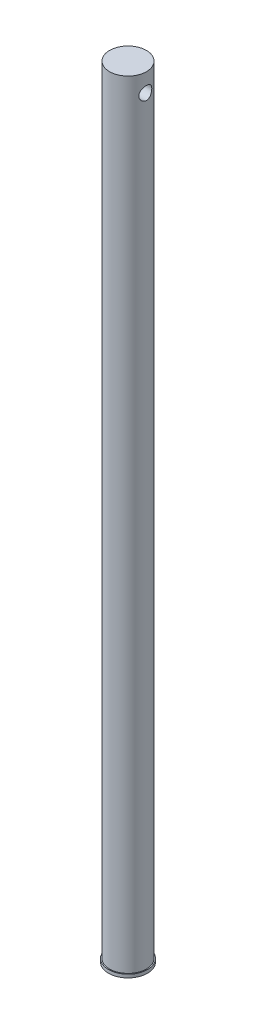
ISO-10303-21;
HEADER;
FILE_DESCRIPTION(('STEP AP214'),'2;1');
FILE_NAME('part.step','',(''),(''),'','','');
FILE_SCHEMA(('AUTOMOTIVE_DESIGN { 1 0 10303 214 1 1 1 1 }'));
ENDSEC;
DATA;
#1=APPLICATION_CONTEXT('core data for automotive mechanical design processes');
#2=APPLICATION_PROTOCOL_DEFINITION('international standard','automotive_design',2000,#1);
#3=PRODUCT_CONTEXT('',#1,'mechanical');
#4=PRODUCT('Part','Part','',(#3));
#5=PRODUCT_RELATED_PRODUCT_CATEGORY('part','',(#4));
#6=PRODUCT_DEFINITION_FORMATION('','',#4);
#7=PRODUCT_DEFINITION_CONTEXT('part definition',#1,'design');
#8=PRODUCT_DEFINITION('design','',#6,#7);
#9=PRODUCT_DEFINITION_SHAPE('','',#8);
#10=(LENGTH_UNIT() NAMED_UNIT(*) SI_UNIT(.MILLI.,.METRE.));
#11=(NAMED_UNIT(*) PLANE_ANGLE_UNIT() SI_UNIT($,.RADIAN.));
#12=(NAMED_UNIT(*) SI_UNIT($,.STERADIAN.) SOLID_ANGLE_UNIT());
#13=UNCERTAINTY_MEASURE_WITH_UNIT(LENGTH_MEASURE(1.E-05),#10,'distance_accuracy_value','');
#14=(GEOMETRIC_REPRESENTATION_CONTEXT(3) GLOBAL_UNCERTAINTY_ASSIGNED_CONTEXT((#13)) GLOBAL_UNIT_ASSIGNED_CONTEXT((#10,
#11,#12)) REPRESENTATION_CONTEXT('',''));
#15=CARTESIAN_POINT('',(0.,0.,0.));
#16=DIRECTION('',(0.,0.,1.));
#17=DIRECTION('',(1.,0.,0.));
#18=AXIS2_PLACEMENT_3D('',#15,#16,#17);
#19=CARTESIAN_POINT('',(0.,381.,0.));
#20=DIRECTION('',(0.,-1.,0.));
#21=DIRECTION('',(0.,0.,-1.));
#22=AXIS2_PLACEMENT_3D('',#19,#20,#21);
#23=CYLINDRICAL_SURFACE('',#22,9.);
#24=CARTESIAN_POINT('',(-8.42136420065063,372.,-3.175));
#25=CARTESIAN_POINT('',(-8.42136150974084,372.172273779632,-3.17500313367558));
#26=CARTESIAN_POINT('',(-8.42670808089815,372.344525767534,-3.16093167724255));
#27=CARTESIAN_POINT('',(-8.44738831325761,372.683885201858,-3.10523707874647));
#28=CARTESIAN_POINT('',(-8.4627226722881,372.850992287961,-3.06361201156008));
#29=CARTESIAN_POINT('',(-8.50142999230871,373.175081631049,-2.95448773313072));
#30=CARTESIAN_POINT('',(-8.5247856310422,373.332084847263,-2.88704424206036));
#31=CARTESIAN_POINT('',(-8.57687751912031,373.632604430906,-2.72839140382439));
#32=CARTESIAN_POINT('',(-8.60561516505424,373.776117283138,-2.63717588559013));
#33=CARTESIAN_POINT('',(-8.66664704765721,374.051881093915,-2.42927986210608));
#34=CARTESIAN_POINT('',(-8.699037413213,374.183454740443,-2.3117289294745));
#35=CARTESIAN_POINT('',(-8.76291757980477,374.425490061538,-2.05635163465563));
#36=CARTESIAN_POINT('',(-8.79440721491501,374.535947867335,-1.91852156516495));
#37=CARTESIAN_POINT('',(-8.85406424843501,374.735774241258,-1.62146040606909));
#38=CARTESIAN_POINT('',(-8.88210559213286,374.824421115152,-1.46171628450465));
#39=CARTESIAN_POINT('',(-8.93056365003233,374.973309950242,-1.1284216480992));
#40=CARTESIAN_POINT('',(-8.9509826830258,375.033560551368,-0.954875351553854));
#41=CARTESIAN_POINT('',(-8.98121392113146,375.121614293695,-0.606013116693167));
#42=CARTESIAN_POINT('',(-8.99140518987648,375.150580331684,-0.431024170453733));
#43=CARTESIAN_POINT('',(-9.00138488825874,375.178953204662,-0.0783923821029128));
#44=CARTESIAN_POINT('',(-9.00117631468531,375.178368554894,0.0992496807437582));
#45=CARTESIAN_POINT('',(-8.99062960898661,375.148366984619,0.443867105376793));
#46=CARTESIAN_POINT('',(-8.98073619267481,375.120215863683,0.610968563133427));
#47=CARTESIAN_POINT('',(-8.95250107946052,375.037989967142,0.93790229861018));
#48=CARTESIAN_POINT('',(-8.93415879527837,374.983913389449,1.09773407016671));
#49=CARTESIAN_POINT('',(-8.89055004160788,374.850702748335,1.40821090083163));
#50=CARTESIAN_POINT('',(-8.8651910247344,374.771231402723,1.55869771253312));
#51=CARTESIAN_POINT('',(-8.81015552569046,374.58977369596,1.84455431214103));
#52=CARTESIAN_POINT('',(-8.78047774895497,374.48778057906,1.97991954571352));
#53=CARTESIAN_POINT('',(-8.71806923990129,374.257920276167,2.23919184160651));
#54=CARTESIAN_POINT('',(-8.68526001664206,374.128978474742,2.36212873401556));
#55=CARTESIAN_POINT('',(-8.62156508884072,373.852063501979,2.58497190998503));
#56=CARTESIAN_POINT('',(-8.59067976039008,373.704086626801,2.68487370078944));
#57=CARTESIAN_POINT('',(-8.53386949631555,373.389890227687,2.86037801067268));
#58=CARTESIAN_POINT('',(-8.50804171526517,373.223394857504,2.93552060796845));
#59=CARTESIAN_POINT('',(-8.46539125944423,372.878967392437,3.05635497519198));
#60=CARTESIAN_POINT('',(-8.44856426022347,372.701040835807,3.10206089021179));
#61=CARTESIAN_POINT('',(-8.42681771259573,372.348291238941,3.16064500486847));
#62=CARTESIAN_POINT('',(-8.42134684933665,372.173754987769,3.17504482542608));
#63=CARTESIAN_POINT('',(-8.42138162146706,371.824711871225,3.17495498997333));
#64=CARTESIAN_POINT('',(-8.42688494288389,371.650205007416,3.16047142419816));
#65=CARTESIAN_POINT('',(-8.44769353226338,371.313483758113,3.10439935241744));
#66=CARTESIAN_POINT('',(-8.46259711219546,371.151057016621,3.06392043873685));
#67=CARTESIAN_POINT('',(-8.50006929550216,370.835351257663,2.95836719697569));
#68=CARTESIAN_POINT('',(-8.52263935683069,370.682073986697,2.89328819036821));
#69=CARTESIAN_POINT('',(-8.57386238415512,370.383151938961,2.73784260998849));
#70=CARTESIAN_POINT('',(-8.60269826317223,370.237952586941,2.64668145764857));
#71=CARTESIAN_POINT('',(-8.66287106222929,369.964365994977,2.44253418510721));
#72=CARTESIAN_POINT('',(-8.69420880080792,369.835984293877,2.3295409047286));
#73=CARTESIAN_POINT('',(-8.75793507880341,369.592378403588,2.0775804644409));
#74=CARTESIAN_POINT('',(-8.7902868253692,369.478263842564,1.93752773367294));
#75=CARTESIAN_POINT('',(-8.85072065334855,369.275056744484,1.63946194177508));
#76=CARTESIAN_POINT('',(-8.87880282353125,369.185963687171,1.48144925417164));
#77=CARTESIAN_POINT('',(-8.92744510495054,369.03606389619,1.15247099606441));
#78=CARTESIAN_POINT('',(-8.9480454764908,368.975105272856,0.981580913915487));
#79=CARTESIAN_POINT('',(-8.97956684467944,368.883088518046,0.631092802474834));
#80=CARTESIAN_POINT('',(-8.99049180643894,368.852018137522,0.451498372195834));
#81=CARTESIAN_POINT('',(-9.001096993685,368.821863829815,0.0987917234462732));
#82=CARTESIAN_POINT('',(-9.00133434179307,368.821195110076,-0.0741696021688782));
#83=CARTESIAN_POINT('',(-8.99194596473683,368.847877928677,-0.417626913375173));
#84=CARTESIAN_POINT('',(-8.9823212078412,368.875226716237,-0.588123139325079));
#85=CARTESIAN_POINT('',(-8.95451860699497,368.956084294502,-0.91845801586464));
#86=CARTESIAN_POINT('',(-8.93651167565383,369.00907113987,-1.07843986742183));
#87=CARTESIAN_POINT('',(-8.89380530321607,369.139202314945,-1.38728445739493));
#88=CARTESIAN_POINT('',(-8.86910461387078,369.216351150786,-1.53614511532464));
#89=CARTESIAN_POINT('',(-8.81430812409888,369.396108033773,-1.8249480939735));
#90=CARTESIAN_POINT('',(-8.78403770358338,369.49960164325,-1.96430556551143));
#91=CARTESIAN_POINT('',(-8.72186340607507,369.727655576016,-2.22418179403337));
#92=CARTESIAN_POINT('',(-8.68995897996657,369.852223014093,-2.34469416214569));
#93=CARTESIAN_POINT('',(-8.62637063508191,370.125613018016,-2.56903732755921));
#94=CARTESIAN_POINT('',(-8.59476205272973,370.275278203089,-2.67186624170761));
#95=CARTESIAN_POINT('',(-8.53705593137355,370.590764641956,-2.8508878315435));
#96=CARTESIAN_POINT('',(-8.51095780975928,370.756584185068,-2.92708332368967));
#97=CARTESIAN_POINT('',(-8.46773324979655,371.099015789174,-3.04987657342727));
#98=CARTESIAN_POINT('',(-8.45056079510719,371.275567145627,-3.09662640829266));
#99=CARTESIAN_POINT('',(-8.42738031458061,371.63475575977,-3.15917920413));
#100=CARTESIAN_POINT('',(-8.42136705300987,371.817390122434,-3.17499667830987));
#101=CARTESIAN_POINT('',(-8.42136420065063,372.,-3.175));
#102=B_SPLINE_CURVE_WITH_KNOTS('',3,(#24,#25,#26,#27,#28,#29,#30,#31,#32,#33,#34,#35,#36,#37,
#38,#39,#40,#41,#42,#43,#44,#45,#46,#47,#48,#49,#50,#51,#52,#53,#54,#55,#56,#57,#58,#59,#60,#61,
#62,#63,#64,#65,#66,#67,#68,#69,#70,#71,#72,#73,#74,#75,#76,#77,#78,#79,#80,#81,#82,#83,#84,#85,
#86,#87,#88,#89,#90,#91,#92,#93,#94,#95,#96,#97,#98,#99,#100,#101),.UNSPECIFIED.,.T.,.F.,(4,2,2,
2,2,2,2,2,2,2,2,2,2,2,2,2,2,2,2,2,2,2,2,2,2,2,2,2,2,2,2,2,2,2,2,2,2,2,4),(0.,0.516143389277584,
1.03232284441184,1.54739452765751,2.0626000536882,2.59835067811291,3.13419936705048,
3.68592224976285,4.23747715518224,4.76773815552892,5.29784635823984,5.8047023361063,
6.3115935507804,6.82551831487162,7.33959744844527,7.88057585024932,8.42165967515937,
8.97229203467949,9.52265960321306,10.0456158849938,10.5684619099664,11.0703530093399,
11.5723396080835,12.0916355194439,12.611102031742,13.1590936790855,13.707073931527,
14.2520601584676,14.7968229393442,15.3131536231758,15.82943361814,16.3356191162764,
16.8418990726654,17.3681847993069,17.8946485624483,18.444940258241,18.9951737435998,
19.5425416331614,20.0896526405582),.UNSPECIFIED.);
#103=CARTESIAN_POINT('',(-8.42136420065063,372.,-3.175));
#104=VERTEX_POINT('',#103);
#105=EDGE_CURVE('E34',#104,#104,#102,.T.);
#106=ORIENTED_EDGE('',*,*,#105,.T.);
#107=EDGE_LOOP('',(#106));
#108=FACE_BOUND('',#107,.T.);
#109=CARTESIAN_POINT('',(8.42136420065063,372.,-3.175));
#110=CARTESIAN_POINT('',(8.42136150974084,371.827726220368,-3.17500313367558));
#111=CARTESIAN_POINT('',(8.42670808089815,371.655474232466,-3.16093167724255));
#112=CARTESIAN_POINT('',(8.44738831325761,371.316114798142,-3.10523707874647));
#113=CARTESIAN_POINT('',(8.4627226722881,371.149007712039,-3.06361201156008));
#114=CARTESIAN_POINT('',(8.50142999230871,370.824918368951,-2.95448773313072));
#115=CARTESIAN_POINT('',(8.5247856310422,370.667915152737,-2.88704424206035));
#116=CARTESIAN_POINT('',(8.57687751912031,370.367395569094,-2.72839140382439));
#117=CARTESIAN_POINT('',(8.60561516505424,370.223882716862,-2.63717588559013));
#118=CARTESIAN_POINT('',(8.66664704765721,369.948118906085,-2.42927986210607));
#119=CARTESIAN_POINT('',(8.699037413213,369.816545259557,-2.31172892947448));
#120=CARTESIAN_POINT('',(8.76291757980478,369.574509938462,-2.0563516346556));
#121=CARTESIAN_POINT('',(8.79440721491501,369.464052132665,-1.91852156516494));
#122=CARTESIAN_POINT('',(8.85406424843501,369.264225758742,-1.6214604060691));
#123=CARTESIAN_POINT('',(8.88210559213286,369.175578884848,-1.46171628450465));
#124=CARTESIAN_POINT('',(8.93056365003233,369.026690049758,-1.1284216480992));
#125=CARTESIAN_POINT('',(8.9509826830258,368.966439448632,-0.954875351553854));
#126=CARTESIAN_POINT('',(8.98121392113146,368.878385706305,-0.606013116693167));
#127=CARTESIAN_POINT('',(8.99140518987648,368.849419668316,-0.431024170453733));
#128=CARTESIAN_POINT('',(9.00138488825874,368.821046795338,-0.0783923821029127));
#129=CARTESIAN_POINT('',(9.00117631468531,368.821631445106,0.0992496807437583));
#130=CARTESIAN_POINT('',(8.99062960898661,368.851633015381,0.443867105376793));
#131=CARTESIAN_POINT('',(8.98073619267481,368.879784136317,0.610968563133427));
#132=CARTESIAN_POINT('',(8.95250107946052,368.962010032858,0.93790229861018));
#133=CARTESIAN_POINT('',(8.93415879527837,369.016086610551,1.09773407016671));
#134=CARTESIAN_POINT('',(8.89055004160788,369.149297251665,1.40821090083163));
#135=CARTESIAN_POINT('',(8.8651910247344,369.228768597277,1.55869771253312));
#136=CARTESIAN_POINT('',(8.81015552569046,369.41022630404,1.84455431214103));
#137=CARTESIAN_POINT('',(8.78047774895497,369.51221942094,1.97991954571352));
#138=CARTESIAN_POINT('',(8.71806923990129,369.742079723833,2.23919184160653));
#139=CARTESIAN_POINT('',(8.68526001664205,369.871021525258,2.3621287340156));
#140=CARTESIAN_POINT('',(8.62156508884071,370.147936498021,2.58497190998507));
#141=CARTESIAN_POINT('',(8.59067976039007,370.295913373199,2.68487370078945));
#142=CARTESIAN_POINT('',(8.53386949631555,370.610109772313,2.86037801067267));
#143=CARTESIAN_POINT('',(8.50804171526517,370.776605142496,2.93552060796845));
#144=CARTESIAN_POINT('',(8.46539125944423,371.121032607563,3.05635497519198));
#145=CARTESIAN_POINT('',(8.44856426022347,371.298959164193,3.10206089021179));
#146=CARTESIAN_POINT('',(8.42681771259573,371.651708761059,3.16064500486847));
#147=CARTESIAN_POINT('',(8.42134684933665,371.826245012231,3.17504482542608));
#148=CARTESIAN_POINT('',(8.42138162146706,372.175288128775,3.17495498997333));
#149=CARTESIAN_POINT('',(8.42688494288389,372.349794992584,3.16047142419816));
#150=CARTESIAN_POINT('',(8.44769353226338,372.686516241887,3.10439935241744));
#151=CARTESIAN_POINT('',(8.46259711219546,372.848942983379,3.06392043873685));
#152=CARTESIAN_POINT('',(8.50006929550216,373.164648742337,2.95836719697569));
#153=CARTESIAN_POINT('',(8.52263935683069,373.317926013303,2.89328819036821));
#154=CARTESIAN_POINT('',(8.57386238415512,373.616848061039,2.73784260998847));
#155=CARTESIAN_POINT('',(8.60269826317224,373.762047413059,2.64668145764855));
#156=CARTESIAN_POINT('',(8.6628710622293,374.035634005024,2.44253418510718));
#157=CARTESIAN_POINT('',(8.69420880080793,374.164015706123,2.32954090472857));
#158=CARTESIAN_POINT('',(8.75793507880341,374.407621596412,2.07758046444089));
#159=CARTESIAN_POINT('',(8.7902868253692,374.521736157436,1.93752773367294));
#160=CARTESIAN_POINT('',(8.85072065334855,374.724943255516,1.63946194177508));
#161=CARTESIAN_POINT('',(8.87880282353125,374.814036312829,1.48144925417164));
#162=CARTESIAN_POINT('',(8.92744510495054,374.96393610381,1.15247099606441));
#163=CARTESIAN_POINT('',(8.9480454764908,375.024894727144,0.981580913915487));
#164=CARTESIAN_POINT('',(8.97956684467944,375.116911481954,0.631092802474834));
#165=CARTESIAN_POINT('',(8.99049180643894,375.147981862478,0.451498372195834));
#166=CARTESIAN_POINT('',(9.001096993685,375.178136170185,0.0987917234462731));
#167=CARTESIAN_POINT('',(9.00133434179307,375.178804889924,-0.0741696021688782));
#168=CARTESIAN_POINT('',(8.99194596473683,375.152122071323,-0.417626913375173));
#169=CARTESIAN_POINT('',(8.9823212078412,375.124773283763,-0.588123139325079));
#170=CARTESIAN_POINT('',(8.95451860699497,375.043915705498,-0.91845801586464));
#171=CARTESIAN_POINT('',(8.93651167565383,374.99092886013,-1.07843986742183));
#172=CARTESIAN_POINT('',(8.89380530321607,374.860797685055,-1.38728445739493));
#173=CARTESIAN_POINT('',(8.86910461387078,374.783648849214,-1.53614511532464));
#174=CARTESIAN_POINT('',(8.81430812409888,374.603891966227,-1.8249480939735));
#175=CARTESIAN_POINT('',(8.78403770358338,374.50039835675,-1.96430556551143));
#176=CARTESIAN_POINT('',(8.72186340607507,374.272344423984,-2.22418179403337));
#177=CARTESIAN_POINT('',(8.68995897996657,374.147776985907,-2.34469416214568));
#178=CARTESIAN_POINT('',(8.6263706350819,373.874386981984,-2.56903732755922));
#179=CARTESIAN_POINT('',(8.59476205272972,373.724721796911,-2.67186624170765));
#180=CARTESIAN_POINT('',(8.53705593137354,373.409235358044,-2.85088783154353));
#181=CARTESIAN_POINT('',(8.51095780975928,373.243415814932,-2.92708332368968));
#182=CARTESIAN_POINT('',(8.46773324979655,372.900984210826,-3.04987657342728));
#183=CARTESIAN_POINT('',(8.45056079510718,372.724432854373,-3.09662640829268));
#184=CARTESIAN_POINT('',(8.42738031458061,372.36524424023,-3.15917920413001));
#185=CARTESIAN_POINT('',(8.42136705300987,372.182609877566,-3.17499667830987));
#186=CARTESIAN_POINT('',(8.42136420065063,372.,-3.175));
#187=B_SPLINE_CURVE_WITH_KNOTS('',3,(#109,#110,#111,#112,#113,#114,#115,#116,#117,#118,#119,
#120,#121,#122,#123,#124,#125,#126,#127,#128,#129,#130,#131,#132,#133,#134,#135,#136,#137,#138,
#139,#140,#141,#142,#143,#144,#145,#146,#147,#148,#149,#150,#151,#152,#153,#154,#155,#156,#157,
#158,#159,#160,#161,#162,#163,#164,#165,#166,#167,#168,#169,#170,#171,#172,#173,#174,#175,#176,
#177,#178,#179,#180,#181,#182,#183,#184,#185,#186),.UNSPECIFIED.,.T.,.F.,(4,2,2,2,2,2,2,2,2,2,2,
2,2,2,2,2,2,2,2,2,2,2,2,2,2,2,2,2,2,2,2,2,2,2,2,2,2,2,4),(0.,0.516143389277584,1.03232284441184,
1.54739452765751,2.0626000536882,2.59835067811293,3.13419936705047,3.68592224976285,
4.23747715518224,4.76773815552892,5.29784635823983,5.8047023361063,6.3115935507804,
6.82551831487161,7.33959744844527,7.8805758502494,8.42165967515937,8.97229203467949,
9.52265960321306,10.0456158849938,10.5684619099664,11.0703530093399,11.5723396080835,
12.0916355194441,12.611102031742,13.1590936790855,13.707073931527,14.2520601584676,
14.7968229393442,15.3131536231758,15.82943361814,16.3356191162764,16.8418990726654,
17.3681847993069,17.8946485624483,18.4449402582411,18.9951737435998,19.5425416331615,
20.0896526405582),.UNSPECIFIED.);
#188=CARTESIAN_POINT('',(8.42136420065063,372.,-3.175));
#189=VERTEX_POINT('',#188);
#190=EDGE_CURVE('E49',#189,#189,#187,.T.);
#191=ORIENTED_EDGE('',*,*,#190,.T.);
#192=EDGE_LOOP('',(#191));
#193=FACE_BOUND('',#192,.T.);
#194=CARTESIAN_POINT('',(0.,381.,0.));
#195=DIRECTION('',(0.,1.,0.));
#196=DIRECTION('',(0.,0.,1.));
#197=AXIS2_PLACEMENT_3D('',#194,#195,#196);
#198=CIRCLE('',#197,9.);
#199=CARTESIAN_POINT('',(0.,381.,9.));
#200=VERTEX_POINT('',#199);
#201=EDGE_CURVE('E41',#200,#200,#198,.T.);
#202=ORIENTED_EDGE('',*,*,#201,.F.);
#203=EDGE_LOOP('',(#202));
#204=FACE_BOUND('',#203,.T.);
#205=CARTESIAN_POINT('',(0.,1.58750000000002,0.));
#206=DIRECTION('',(0.,-1.,0.));
#207=DIRECTION('',(0.,0.,-1.));
#208=AXIS2_PLACEMENT_3D('',#205,#206,#207);
#209=CIRCLE('',#208,9.);
#210=CARTESIAN_POINT('',(0.,1.58750000000002,-9.));
#211=VERTEX_POINT('',#210);
#212=EDGE_CURVE('E10',#211,#211,#209,.T.);
#213=ORIENTED_EDGE('',*,*,#212,.F.);
#214=EDGE_LOOP('',(#213));
#215=FACE_BOUND('',#214,.T.);
#216=ADVANCED_FACE('F30',(#108,#193,#204,#215),#23,.T.);
#217=CARTESIAN_POINT('',(0.,381.,0.));
#218=DIRECTION('',(0.,1.,0.));
#219=DIRECTION('',(0.,0.,1.));
#220=AXIS2_PLACEMENT_3D('',#217,#218,#219);
#221=PLANE('',#220);
#222=ORIENTED_EDGE('',*,*,#201,.T.);
#223=EDGE_LOOP('',(#222));
#224=FACE_BOUND('',#223,.T.);
#225=ADVANCED_FACE('F66',(#224),#221,.T.);
#226=CARTESIAN_POINT('',(0.,1.5875,0.));
#227=DIRECTION('',(0.,-1.,0.));
#228=DIRECTION('',(0.,0.,-1.));
#229=AXIS2_PLACEMENT_3D('',#226,#227,#228);
#230=CYLINDRICAL_SURFACE('',#229,9.5);
#231=CARTESIAN_POINT('',(0.,1.5875,0.));
#232=DIRECTION('',(0.,-1.,0.));
#233=DIRECTION('',(0.,0.,-1.));
#234=AXIS2_PLACEMENT_3D('',#231,#232,#233);
#235=CIRCLE('',#234,9.5);
#236=CARTESIAN_POINT('',(0.,1.5875,-9.5));
#237=VERTEX_POINT('',#236);
#238=EDGE_CURVE('E46',#237,#237,#235,.T.);
#239=ORIENTED_EDGE('',*,*,#238,.T.);
#240=EDGE_LOOP('',(#239));
#241=FACE_BOUND('',#240,.T.);
#242=CARTESIAN_POINT('',(0.,0.,0.));
#243=DIRECTION('',(0.,-1.,0.));
#244=DIRECTION('',(0.,0.,-1.));
#245=AXIS2_PLACEMENT_3D('',#242,#243,#244);
#246=CIRCLE('',#245,9.5);
#247=CARTESIAN_POINT('',(0.,0.,-9.5));
#248=VERTEX_POINT('',#247);
#249=EDGE_CURVE('E87',#248,#248,#246,.T.);
#250=ORIENTED_EDGE('',*,*,#249,.F.);
#251=EDGE_LOOP('',(#250));
#252=FACE_BOUND('',#251,.T.);
#253=ADVANCED_FACE('F63',(#241,#252),#230,.T.);
#254=CARTESIAN_POINT('',(0.,1.5875,0.));
#255=DIRECTION('',(0.,-1.,0.));
#256=DIRECTION('',(0.,0.,-1.));
#257=AXIS2_PLACEMENT_3D('',#254,#255,#256);
#258=PLANE('',#257);
#259=ORIENTED_EDGE('',*,*,#212,.T.);
#260=EDGE_LOOP('',(#259));
#261=FACE_BOUND('',#260,.T.);
#262=ORIENTED_EDGE('',*,*,#238,.F.);
#263=EDGE_LOOP('',(#262));
#264=FACE_BOUND('',#263,.T.);
#265=ADVANCED_FACE('F59',(#261,#264),#258,.F.);
#266=CARTESIAN_POINT('',(0.,0.,0.));
#267=DIRECTION('',(0.,1.,0.));
#268=DIRECTION('',(0.,0.,1.));
#269=AXIS2_PLACEMENT_3D('',#266,#267,#268);
#270=PLANE('',#269);
#271=ORIENTED_EDGE('',*,*,#249,.T.);
#272=EDGE_LOOP('',(#271));
#273=FACE_BOUND('',#272,.T.);
#274=ADVANCED_FACE('F57',(#273),#270,.F.);
#275=CARTESIAN_POINT('',(-9.5,372.,0.));
#276=DIRECTION('',(1.,0.,0.));
#277=DIRECTION('',(0.,0.,-1.));
#278=AXIS2_PLACEMENT_3D('',#275,#276,#277);
#279=CYLINDRICAL_SURFACE('',#278,3.175);
#280=ORIENTED_EDGE('',*,*,#190,.F.);
#281=EDGE_LOOP('',(#280));
#282=FACE_BOUND('',#281,.T.);
#283=ORIENTED_EDGE('',*,*,#105,.F.);
#284=EDGE_LOOP('',(#283));
#285=FACE_BOUND('',#284,.T.);
#286=ADVANCED_FACE('F53',(#282,#285),#279,.F.);
#287=CLOSED_SHELL('',(#216,#225,#253,#265,#274,#286));
#288=MANIFOLD_SOLID_BREP('B2',#287);
#289=ADVANCED_BREP_SHAPE_REPRESENTATION('',(#18,#288),#14);
#290=SHAPE_DEFINITION_REPRESENTATION(#9,#289);
ENDSEC;
END-ISO-10303-21;
